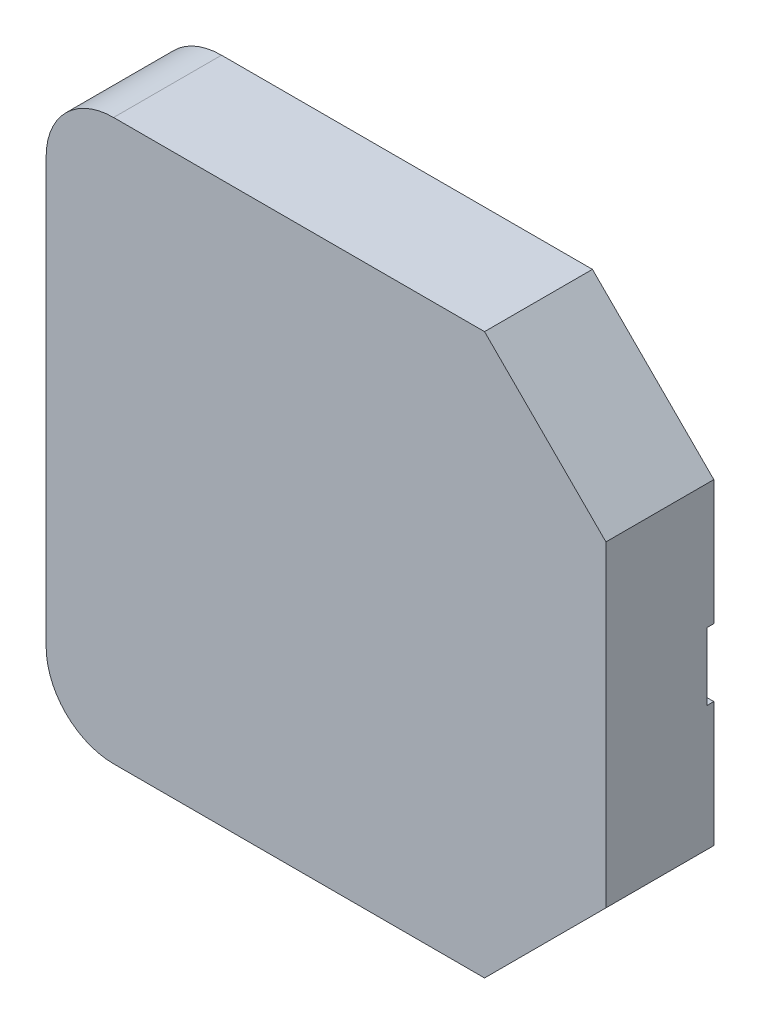
ISO-10303-21;
HEADER;
FILE_DESCRIPTION(('STEP AP214'),'2;1');
FILE_NAME('part.step','',(''),(''),'','','');
FILE_SCHEMA(('AUTOMOTIVE_DESIGN { 1 0 10303 214 1 1 1 1 }'));
ENDSEC;
DATA;
#1=APPLICATION_CONTEXT('core data for automotive mechanical design processes');
#2=APPLICATION_PROTOCOL_DEFINITION('international standard','automotive_design',2000,#1);
#3=PRODUCT_CONTEXT('',#1,'mechanical');
#4=PRODUCT('Part','Part','',(#3));
#5=PRODUCT_RELATED_PRODUCT_CATEGORY('part','',(#4));
#6=PRODUCT_DEFINITION_FORMATION('','',#4);
#7=PRODUCT_DEFINITION_CONTEXT('part definition',#1,'design');
#8=PRODUCT_DEFINITION('design','',#6,#7);
#9=PRODUCT_DEFINITION_SHAPE('','',#8);
#10=(LENGTH_UNIT() NAMED_UNIT(*) SI_UNIT(.MILLI.,.METRE.));
#11=(NAMED_UNIT(*) PLANE_ANGLE_UNIT() SI_UNIT($,.RADIAN.));
#12=(NAMED_UNIT(*) SI_UNIT($,.STERADIAN.) SOLID_ANGLE_UNIT());
#13=UNCERTAINTY_MEASURE_WITH_UNIT(LENGTH_MEASURE(1.E-05),#10,'distance_accuracy_value','');
#14=(GEOMETRIC_REPRESENTATION_CONTEXT(3) GLOBAL_UNCERTAINTY_ASSIGNED_CONTEXT((#13)) GLOBAL_UNIT_ASSIGNED_CONTEXT((#10,
#11,#12)) REPRESENTATION_CONTEXT('',''));
#15=CARTESIAN_POINT('',(0.,0.,0.));
#16=DIRECTION('',(0.,0.,1.));
#17=DIRECTION('',(1.,0.,0.));
#18=AXIS2_PLACEMENT_3D('',#15,#16,#17);
#19=CARTESIAN_POINT('',(4.15,4.494149457923,1.6));
#20=DIRECTION('',(0.,0.,1.));
#21=DIRECTION('',(1.,0.,0.));
#22=AXIS2_PLACEMENT_3D('',#19,#20,#21);
#23=PLANE('',#22);
#24=CARTESIAN_POINT('',(1.,7.644149457923,1.6));
#25=DIRECTION('',(0.,0.,-1.));
#26=DIRECTION('',(-0.707106781186547,0.707106781186548,0.));
#27=AXIS2_PLACEMENT_3D('',#24,#25,#26);
#28=CIRCLE('',#27,1.);
#29=CARTESIAN_POINT('',(0.,7.644149457923,1.6));
#30=VERTEX_POINT('',#29);
#31=CARTESIAN_POINT('',(0.292893218813453,8.35125623910955,1.6));
#32=VERTEX_POINT('',#31);
#33=EDGE_CURVE('E354',#30,#32,#28,.T.);
#34=ORIENTED_EDGE('',*,*,#33,.F.);
#35=DIRECTION('',(0.,1.,0.));
#36=VECTOR('',#35,1.);
#37=CARTESIAN_POINT('',(0.,1.344149457923,1.6));
#38=LINE('',#37,#36);
#39=CARTESIAN_POINT('',(0.,1.344149457923,1.6));
#40=VERTEX_POINT('',#39);
#41=EDGE_CURVE('E231',#40,#30,#38,.T.);
#42=ORIENTED_EDGE('',*,*,#41,.F.);
#43=CARTESIAN_POINT('',(1.,1.344149457923,1.6));
#44=DIRECTION('',(0.,0.,-1.));
#45=DIRECTION('',(-0.707106781186547,-0.707106781186548,0.));
#46=AXIS2_PLACEMENT_3D('',#43,#44,#45);
#47=CIRCLE('',#46,1.);
#48=CARTESIAN_POINT('',(0.292893218813453,0.637042676736448,1.6));
#49=VERTEX_POINT('',#48);
#50=EDGE_CURVE('E263',#49,#40,#47,.T.);
#51=ORIENTED_EDGE('',*,*,#50,.F.);
#52=CARTESIAN_POINT('',(1.,1.344149457923,1.6));
#53=DIRECTION('',(0.,0.,-1.));
#54=DIRECTION('',(-0.707106781186547,-0.707106781186548,0.));
#55=AXIS2_PLACEMENT_3D('',#52,#53,#54);
#56=CIRCLE('',#55,1.);
#57=CARTESIAN_POINT('',(1.,0.344149457922996,1.6));
#58=VERTEX_POINT('',#57);
#59=EDGE_CURVE('E336',#58,#49,#56,.T.);
#60=ORIENTED_EDGE('',*,*,#59,.F.);
#61=DIRECTION('',(-1.,0.,0.));
#62=VECTOR('',#61,1.);
#63=CARTESIAN_POINT('',(6.5,0.344149457922996,1.6));
#64=LINE('',#63,#62);
#65=CARTESIAN_POINT('',(6.5,0.344149457922996,1.6));
#66=VERTEX_POINT('',#65);
#67=EDGE_CURVE('E262',#66,#58,#64,.T.);
#68=ORIENTED_EDGE('',*,*,#67,.F.);
#69=DIRECTION('',(-0.707106781186548,-0.707106781186547,0.));
#70=VECTOR('',#69,1.);
#71=CARTESIAN_POINT('',(8.3,2.144149457923,1.6));
#72=LINE('',#71,#70);
#73=CARTESIAN_POINT('',(8.3,2.144149457923,1.6));
#74=VERTEX_POINT('',#73);
#75=EDGE_CURVE('E319',#74,#66,#72,.T.);
#76=ORIENTED_EDGE('',*,*,#75,.F.);
#77=DIRECTION('',(0.,-1.,0.));
#78=VECTOR('',#77,1.);
#79=CARTESIAN_POINT('',(8.3,6.844149457923,1.6));
#80=LINE('',#79,#78);
#81=CARTESIAN_POINT('',(8.3,6.844149457923,1.6));
#82=VERTEX_POINT('',#81);
#83=EDGE_CURVE('E11',#82,#74,#80,.T.);
#84=ORIENTED_EDGE('',*,*,#83,.F.);
#85=DIRECTION('',(0.707106781186547,-0.707106781186548,0.));
#86=VECTOR('',#85,1.);
#87=CARTESIAN_POINT('',(6.5,8.644149457923,1.6));
#88=LINE('',#87,#86);
#89=CARTESIAN_POINT('',(6.5,8.644149457923,1.6));
#90=VERTEX_POINT('',#89);
#91=EDGE_CURVE('E313',#90,#82,#88,.T.);
#92=ORIENTED_EDGE('',*,*,#91,.F.);
#93=DIRECTION('',(1.,0.,0.));
#94=VECTOR('',#93,1.);
#95=CARTESIAN_POINT('',(1.,8.644149457923,1.6));
#96=LINE('',#95,#94);
#97=CARTESIAN_POINT('',(1.,8.644149457923,1.6));
#98=VERTEX_POINT('',#97);
#99=EDGE_CURVE('E317',#98,#90,#96,.T.);
#100=ORIENTED_EDGE('',*,*,#99,.F.);
#101=CARTESIAN_POINT('',(1.,7.644149457923,1.6));
#102=DIRECTION('',(0.,0.,-1.));
#103=DIRECTION('',(-0.707106781186547,0.707106781186548,0.));
#104=AXIS2_PLACEMENT_3D('',#101,#102,#103);
#105=CIRCLE('',#104,1.);
#106=EDGE_CURVE('E234',#32,#98,#105,.T.);
#107=ORIENTED_EDGE('',*,*,#106,.F.);
#108=EDGE_LOOP('',(#34,#42,#51,#60,#68,#76,#84,#92,#100,#107));
#109=FACE_BOUND('',#108,.T.);
#110=ADVANCED_FACE('F17',(#109),#23,.T.);
#111=CARTESIAN_POINT('',(8.3,8.644149457923,0.));
#112=DIRECTION('',(1.,0.,0.));
#113=DIRECTION('',(0.,1.,0.));
#114=AXIS2_PLACEMENT_3D('',#111,#112,#113);
#115=PLANE('',#114);
#116=DIRECTION('',(0.,0.,-1.));
#117=VECTOR('',#116,1.);
#118=CARTESIAN_POINT('',(8.3,4.99414945792299,0.1));
#119=LINE('',#118,#117);
#120=CARTESIAN_POINT('',(8.3,4.99414945792299,0.1));
#121=VERTEX_POINT('',#120);
#122=CARTESIAN_POINT('',(8.3,4.99414945792299,0.));
#123=VERTEX_POINT('',#122);
#124=EDGE_CURVE('E184',#121,#123,#119,.T.);
#125=ORIENTED_EDGE('',*,*,#124,.T.);
#126=DIRECTION('',(0.,1.,0.));
#127=VECTOR('',#126,1.);
#128=CARTESIAN_POINT('',(8.3,4.994149457923,0.));
#129=LINE('',#128,#127);
#130=CARTESIAN_POINT('',(8.3,6.844149457923,0.));
#131=VERTEX_POINT('',#130);
#132=EDGE_CURVE('E300',#123,#131,#129,.T.);
#133=ORIENTED_EDGE('',*,*,#132,.T.);
#134=DIRECTION('',(0.,0.,-1.));
#135=VECTOR('',#134,1.);
#136=CARTESIAN_POINT('',(8.3,6.844149457923,1.6));
#137=LINE('',#136,#135);
#138=EDGE_CURVE('E309',#82,#131,#137,.T.);
#139=ORIENTED_EDGE('',*,*,#138,.F.);
#140=ORIENTED_EDGE('',*,*,#83,.T.);
#141=DIRECTION('',(0.,0.,1.));
#142=VECTOR('',#141,1.);
#143=CARTESIAN_POINT('',(8.3,2.144149457923,0.));
#144=LINE('',#143,#142);
#145=CARTESIAN_POINT('',(8.3,2.144149457923,0.));
#146=VERTEX_POINT('',#145);
#147=EDGE_CURVE('E26',#146,#74,#144,.T.);
#148=ORIENTED_EDGE('',*,*,#147,.F.);
#149=DIRECTION('',(0.,1.,0.));
#150=VECTOR('',#149,1.);
#151=CARTESIAN_POINT('',(8.3,2.144149457923,0.));
#152=LINE('',#151,#150);
#153=CARTESIAN_POINT('',(8.3,3.99414945792299,0.));
#154=VERTEX_POINT('',#153);
#155=EDGE_CURVE('E267',#146,#154,#152,.T.);
#156=ORIENTED_EDGE('',*,*,#155,.T.);
#157=DIRECTION('',(0.,0.,1.));
#158=VECTOR('',#157,1.);
#159=CARTESIAN_POINT('',(8.3,3.994149457923,0.));
#160=LINE('',#159,#158);
#161=CARTESIAN_POINT('',(8.3,3.99414945792299,0.1));
#162=VERTEX_POINT('',#161);
#163=EDGE_CURVE('E187',#154,#162,#160,.T.);
#164=ORIENTED_EDGE('',*,*,#163,.T.);
#165=DIRECTION('',(0.,1.,0.));
#166=VECTOR('',#165,1.);
#167=CARTESIAN_POINT('',(8.3,3.99414945792299,0.1));
#168=LINE('',#167,#166);
#169=EDGE_CURVE('E181',#162,#121,#168,.T.);
#170=ORIENTED_EDGE('',*,*,#169,.T.);
#171=EDGE_LOOP('',(#125,#133,#139,#140,#148,#156,#164,#170));
#172=FACE_BOUND('',#171,.T.);
#173=ADVANCED_FACE('F19',(#172),#115,.T.);
#174=CARTESIAN_POINT('',(7.4,1.244149457923,0.));
#175=DIRECTION('',(0.707106781186547,-0.707106781186548,0.));
#176=DIRECTION('',(0.,0.,-1.));
#177=AXIS2_PLACEMENT_3D('',#174,#175,#176);
#178=PLANE('',#177);
#179=ORIENTED_EDGE('',*,*,#75,.T.);
#180=DIRECTION('',(0.,0.,-1.));
#181=VECTOR('',#180,1.);
#182=CARTESIAN_POINT('',(6.5,0.344149457922996,1.6));
#183=LINE('',#182,#181);
#184=CARTESIAN_POINT('',(6.5,0.344149457922996,0.));
#185=VERTEX_POINT('',#184);
#186=EDGE_CURVE('E259',#66,#185,#183,.T.);
#187=ORIENTED_EDGE('',*,*,#186,.T.);
#188=DIRECTION('',(0.707106781186548,0.707106781186547,0.));
#189=VECTOR('',#188,1.);
#190=CARTESIAN_POINT('',(6.5,0.344149457922996,0.));
#191=LINE('',#190,#189);
#192=EDGE_CURVE('E273',#185,#146,#191,.T.);
#193=ORIENTED_EDGE('',*,*,#192,.T.);
#194=ORIENTED_EDGE('',*,*,#147,.T.);
#195=EDGE_LOOP('',(#179,#187,#193,#194));
#196=FACE_BOUND('',#195,.T.);
#197=ADVANCED_FACE('F450',(#196),#178,.T.);
#198=CARTESIAN_POINT('',(0.,8.644149457923,0.));
#199=DIRECTION('',(0.,1.,0.));
#200=DIRECTION('',(1.,0.,0.));
#201=AXIS2_PLACEMENT_3D('',#198,#199,#200);
#202=PLANE('',#201);
#203=DIRECTION('',(0.,0.,-1.));
#204=VECTOR('',#203,1.);
#205=CARTESIAN_POINT('',(1.,8.644149457923,1.6));
#206=LINE('',#205,#204);
#207=CARTESIAN_POINT('',(1.,8.644149457923,0.));
#208=VERTEX_POINT('',#207);
#209=EDGE_CURVE('E288',#98,#208,#206,.T.);
#210=ORIENTED_EDGE('',*,*,#209,.F.);
#211=ORIENTED_EDGE('',*,*,#99,.T.);
#212=DIRECTION('',(0.,0.,1.));
#213=VECTOR('',#212,1.);
#214=CARTESIAN_POINT('',(6.5,8.644149457923,0.));
#215=LINE('',#214,#213);
#216=CARTESIAN_POINT('',(6.5,8.644149457923,0.));
#217=VERTEX_POINT('',#216);
#218=EDGE_CURVE('E312',#217,#90,#215,.T.);
#219=ORIENTED_EDGE('',*,*,#218,.F.);
#220=DIRECTION('',(-1.,0.,0.));
#221=VECTOR('',#220,1.);
#222=CARTESIAN_POINT('',(6.5,8.644149457923,0.));
#223=LINE('',#222,#221);
#224=EDGE_CURVE('E219',#217,#208,#223,.T.);
#225=ORIENTED_EDGE('',*,*,#224,.T.);
#226=EDGE_LOOP('',(#210,#211,#219,#225));
#227=FACE_BOUND('',#226,.T.);
#228=ADVANCED_FACE('F455',(#227),#202,.T.);
#229=CARTESIAN_POINT('',(7.4,7.744149457923,0.));
#230=DIRECTION('',(0.707106781186548,0.707106781186548,0.));
#231=DIRECTION('',(0.,0.,-1.));
#232=AXIS2_PLACEMENT_3D('',#229,#230,#231);
#233=PLANE('',#232);
#234=ORIENTED_EDGE('',*,*,#91,.T.);
#235=ORIENTED_EDGE('',*,*,#138,.T.);
#236=DIRECTION('',(-0.707106781186547,0.707106781186548,0.));
#237=VECTOR('',#236,1.);
#238=CARTESIAN_POINT('',(8.3,6.844149457923,0.));
#239=LINE('',#238,#237);
#240=EDGE_CURVE('E223',#131,#217,#239,.T.);
#241=ORIENTED_EDGE('',*,*,#240,.T.);
#242=ORIENTED_EDGE('',*,*,#218,.T.);
#243=EDGE_LOOP('',(#234,#235,#241,#242));
#244=FACE_BOUND('',#243,.T.);
#245=ADVANCED_FACE('F453',(#244),#233,.T.);
#246=CARTESIAN_POINT('',(8.3,0.344149457922996,0.));
#247=DIRECTION('',(0.,-1.,0.));
#248=DIRECTION('',(0.,0.,-1.));
#249=AXIS2_PLACEMENT_3D('',#246,#247,#248);
#250=PLANE('',#249);
#251=DIRECTION('',(0.,0.,1.));
#252=VECTOR('',#251,1.);
#253=CARTESIAN_POINT('',(1.,0.344149457922996,0.));
#254=LINE('',#253,#252);
#255=CARTESIAN_POINT('',(1.,0.344149457922996,0.));
#256=VERTEX_POINT('',#255);
#257=EDGE_CURVE('E332',#256,#58,#254,.T.);
#258=ORIENTED_EDGE('',*,*,#257,.F.);
#259=DIRECTION('',(1.,0.,0.));
#260=VECTOR('',#259,1.);
#261=CARTESIAN_POINT('',(1.,0.344149457922996,0.));
#262=LINE('',#261,#260);
#263=EDGE_CURVE('E277',#256,#185,#262,.T.);
#264=ORIENTED_EDGE('',*,*,#263,.T.);
#265=ORIENTED_EDGE('',*,*,#186,.F.);
#266=ORIENTED_EDGE('',*,*,#67,.T.);
#267=EDGE_LOOP('',(#258,#264,#265,#266));
#268=FACE_BOUND('',#267,.T.);
#269=ADVANCED_FACE('F377',(#268),#250,.T.);
#270=CARTESIAN_POINT('',(1.,1.344149457923,0.));
#271=DIRECTION('',(0.,0.,-1.));
#272=DIRECTION('',(-0.707106781186547,-0.707106781186548,0.));
#273=AXIS2_PLACEMENT_3D('',#270,#271,#272);
#274=CYLINDRICAL_SURFACE('',#273,1.);
#275=DIRECTION('',(0.,0.,1.));
#276=VECTOR('',#275,1.);
#277=CARTESIAN_POINT('',(0.292893218813453,0.637042676736448,0.));
#278=LINE('',#277,#276);
#279=CARTESIAN_POINT('',(0.292893218813453,0.637042676736448,0.));
#280=VERTEX_POINT('',#279);
#281=EDGE_CURVE('E386',#280,#49,#278,.T.);
#282=ORIENTED_EDGE('',*,*,#281,.T.);
#283=ORIENTED_EDGE('',*,*,#50,.T.);
#284=DIRECTION('',(0.,0.,-1.));
#285=VECTOR('',#284,1.);
#286=CARTESIAN_POINT('',(0.,1.344149457923,1.6));
#287=LINE('',#286,#285);
#288=CARTESIAN_POINT('',(0.,1.344149457923,0.));
#289=VERTEX_POINT('',#288);
#290=EDGE_CURVE('E235',#40,#289,#287,.T.);
#291=ORIENTED_EDGE('',*,*,#290,.T.);
#292=CARTESIAN_POINT('',(1.,1.344149457923,0.));
#293=DIRECTION('',(0.,0.,1.));
#294=DIRECTION('',(-0.707106781186547,-0.707106781186548,0.));
#295=AXIS2_PLACEMENT_3D('',#292,#293,#294);
#296=CIRCLE('',#295,1.);
#297=EDGE_CURVE('E281',#289,#280,#296,.T.);
#298=ORIENTED_EDGE('',*,*,#297,.T.);
#299=EDGE_LOOP('',(#282,#283,#291,#298));
#300=FACE_BOUND('',#299,.T.);
#301=ADVANCED_FACE('F485',(#300),#274,.T.);
#302=CARTESIAN_POINT('',(1.,7.644149457923,0.));
#303=DIRECTION('',(0.,0.,-1.));
#304=DIRECTION('',(-0.707106781186547,0.707106781186548,0.));
#305=AXIS2_PLACEMENT_3D('',#302,#303,#304);
#306=CYLINDRICAL_SURFACE('',#305,1.);
#307=DIRECTION('',(0.,0.,1.));
#308=VECTOR('',#307,1.);
#309=CARTESIAN_POINT('',(0.292893218813453,8.35125623910955,0.));
#310=LINE('',#309,#308);
#311=CARTESIAN_POINT('',(0.292893218813453,8.35125623910955,0.));
#312=VERTEX_POINT('',#311);
#313=EDGE_CURVE('E346',#312,#32,#310,.T.);
#314=ORIENTED_EDGE('',*,*,#313,.T.);
#315=ORIENTED_EDGE('',*,*,#106,.T.);
#316=ORIENTED_EDGE('',*,*,#209,.T.);
#317=CARTESIAN_POINT('',(1.,7.644149457923,0.));
#318=DIRECTION('',(0.,0.,1.));
#319=DIRECTION('',(-0.707106781186547,0.707106781186548,0.));
#320=AXIS2_PLACEMENT_3D('',#317,#318,#319);
#321=CIRCLE('',#320,1.);
#322=EDGE_CURVE('E224',#208,#312,#321,.T.);
#323=ORIENTED_EDGE('',*,*,#322,.T.);
#324=EDGE_LOOP('',(#314,#315,#316,#323));
#325=FACE_BOUND('',#324,.T.);
#326=ADVANCED_FACE('F415',(#325),#306,.T.);
#327=CARTESIAN_POINT('',(0.,0.344149457922996,0.));
#328=DIRECTION('',(-1.,0.,0.));
#329=DIRECTION('',(0.,0.,1.));
#330=AXIS2_PLACEMENT_3D('',#327,#328,#329);
#331=PLANE('',#330);
#332=DIRECTION('',(0.,0.,1.));
#333=VECTOR('',#332,1.);
#334=CARTESIAN_POINT('',(0.,4.994149457923,0.));
#335=LINE('',#334,#333);
#336=CARTESIAN_POINT('',(0.,4.994149457923,0.));
#337=VERTEX_POINT('',#336);
#338=CARTESIAN_POINT('',(0.,4.994149457923,0.1));
#339=VERTEX_POINT('',#338);
#340=EDGE_CURVE('E239',#337,#339,#335,.T.);
#341=ORIENTED_EDGE('',*,*,#340,.T.);
#342=DIRECTION('',(0.,-1.,0.));
#343=VECTOR('',#342,1.);
#344=CARTESIAN_POINT('',(0.,4.994149457923,0.1));
#345=LINE('',#344,#343);
#346=CARTESIAN_POINT('',(0.,3.994149457923,0.1));
#347=VERTEX_POINT('',#346);
#348=EDGE_CURVE('E264',#339,#347,#345,.T.);
#349=ORIENTED_EDGE('',*,*,#348,.T.);
#350=DIRECTION('',(0.,0.,-1.));
#351=VECTOR('',#350,1.);
#352=CARTESIAN_POINT('',(0.,3.994149457923,0.1));
#353=LINE('',#352,#351);
#354=CARTESIAN_POINT('',(0.,3.994149457923,0.));
#355=VERTEX_POINT('',#354);
#356=EDGE_CURVE('E258',#347,#355,#353,.T.);
#357=ORIENTED_EDGE('',*,*,#356,.T.);
#358=DIRECTION('',(0.,-1.,0.));
#359=VECTOR('',#358,1.);
#360=CARTESIAN_POINT('',(0.,3.994149457923,0.));
#361=LINE('',#360,#359);
#362=EDGE_CURVE('E284',#355,#289,#361,.T.);
#363=ORIENTED_EDGE('',*,*,#362,.T.);
#364=ORIENTED_EDGE('',*,*,#290,.F.);
#365=ORIENTED_EDGE('',*,*,#41,.T.);
#366=DIRECTION('',(0.,0.,1.));
#367=VECTOR('',#366,1.);
#368=CARTESIAN_POINT('',(0.,7.644149457923,0.));
#369=LINE('',#368,#367);
#370=CARTESIAN_POINT('',(0.,7.644149457923,0.));
#371=VERTEX_POINT('',#370);
#372=EDGE_CURVE('E358',#371,#30,#369,.T.);
#373=ORIENTED_EDGE('',*,*,#372,.F.);
#374=DIRECTION('',(0.,-1.,0.));
#375=VECTOR('',#374,1.);
#376=CARTESIAN_POINT('',(0.,7.644149457923,0.));
#377=LINE('',#376,#375);
#378=EDGE_CURVE('E292',#371,#337,#377,.T.);
#379=ORIENTED_EDGE('',*,*,#378,.T.);
#380=EDGE_LOOP('',(#341,#349,#357,#363,#364,#365,#373,#379));
#381=FACE_BOUND('',#380,.T.);
#382=ADVANCED_FACE('F411',(#381),#331,.T.);
#383=CARTESIAN_POINT('',(4.15,4.494149457923,0.));
#384=DIRECTION('',(0.,0.,1.));
#385=DIRECTION('',(1.,0.,0.));
#386=AXIS2_PLACEMENT_3D('',#383,#384,#385);
#387=PLANE('',#386);
#388=DIRECTION('',(-1.,0.,0.));
#389=VECTOR('',#388,1.);
#390=CARTESIAN_POINT('',(8.3,4.99414945792299,0.));
#391=LINE('',#390,#389);
#392=CARTESIAN_POINT('',(5.25,4.994149457923,0.));
#393=VERTEX_POINT('',#392);
#394=EDGE_CURVE('E200',#123,#393,#391,.T.);
#395=ORIENTED_EDGE('',*,*,#394,.T.);
#396=CARTESIAN_POINT('',(5.25,4.494149457923,0.));
#397=DIRECTION('',(0.,0.,1.));
#398=DIRECTION('',(0.,1.,0.));
#399=AXIS2_PLACEMENT_3D('',#396,#397,#398);
#400=CIRCLE('',#399,0.5);
#401=CARTESIAN_POINT('',(5.25,3.994149457923,0.));
#402=VERTEX_POINT('',#401);
#403=EDGE_CURVE('E215',#393,#402,#400,.T.);
#404=ORIENTED_EDGE('',*,*,#403,.T.);
#405=DIRECTION('',(1.,0.,0.));
#406=VECTOR('',#405,1.);
#407=CARTESIAN_POINT('',(5.25,3.99414945792299,0.));
#408=LINE('',#407,#406);
#409=EDGE_CURVE('E342',#402,#154,#408,.T.);
#410=ORIENTED_EDGE('',*,*,#409,.T.);
#411=ORIENTED_EDGE('',*,*,#155,.F.);
#412=ORIENTED_EDGE('',*,*,#192,.F.);
#413=ORIENTED_EDGE('',*,*,#263,.F.);
#414=CARTESIAN_POINT('',(1.,1.344149457923,0.));
#415=DIRECTION('',(0.,0.,1.));
#416=DIRECTION('',(-0.707106781186547,-0.707106781186548,0.));
#417=AXIS2_PLACEMENT_3D('',#414,#415,#416);
#418=CIRCLE('',#417,1.);
#419=EDGE_CURVE('E337',#280,#256,#418,.T.);
#420=ORIENTED_EDGE('',*,*,#419,.F.);
#421=ORIENTED_EDGE('',*,*,#297,.F.);
#422=ORIENTED_EDGE('',*,*,#362,.F.);
#423=DIRECTION('',(1.,0.,0.));
#424=VECTOR('',#423,1.);
#425=CARTESIAN_POINT('',(0.,3.994149457923,0.));
#426=LINE('',#425,#424);
#427=CARTESIAN_POINT('',(3.05,3.994149457923,0.));
#428=VERTEX_POINT('',#427);
#429=EDGE_CURVE('E255',#355,#428,#426,.T.);
#430=ORIENTED_EDGE('',*,*,#429,.T.);
#431=CARTESIAN_POINT('',(3.05,4.494149457923,0.));
#432=DIRECTION('',(0.,0.,1.));
#433=DIRECTION('',(0.,1.,0.));
#434=AXIS2_PLACEMENT_3D('',#431,#432,#433);
#435=CIRCLE('',#434,0.5);
#436=CARTESIAN_POINT('',(3.05,4.994149457923,0.));
#437=VERTEX_POINT('',#436);
#438=EDGE_CURVE('E228',#428,#437,#435,.T.);
#439=ORIENTED_EDGE('',*,*,#438,.T.);
#440=DIRECTION('',(-1.,0.,0.));
#441=VECTOR('',#440,1.);
#442=CARTESIAN_POINT('',(3.05,4.994149457923,0.));
#443=LINE('',#442,#441);
#444=EDGE_CURVE('E243',#437,#337,#443,.T.);
#445=ORIENTED_EDGE('',*,*,#444,.T.);
#446=ORIENTED_EDGE('',*,*,#378,.F.);
#447=CARTESIAN_POINT('',(1.,7.644149457923,0.));
#448=DIRECTION('',(0.,0.,1.));
#449=DIRECTION('',(-0.707106781186547,0.707106781186548,0.));
#450=AXIS2_PLACEMENT_3D('',#447,#448,#449);
#451=CIRCLE('',#450,1.);
#452=EDGE_CURVE('E350',#312,#371,#451,.T.);
#453=ORIENTED_EDGE('',*,*,#452,.F.);
#454=ORIENTED_EDGE('',*,*,#322,.F.);
#455=ORIENTED_EDGE('',*,*,#224,.F.);
#456=ORIENTED_EDGE('',*,*,#240,.F.);
#457=ORIENTED_EDGE('',*,*,#132,.F.);
#458=EDGE_LOOP('',(#395,#404,#410,#411,#412,#413,#420,#421,#422,#430,#439,#445,#446,#453,#454,
#455,#456,#457));
#459=FACE_BOUND('',#458,.T.);
#460=ADVANCED_FACE('F418',(#459),#387,.F.);
#461=CARTESIAN_POINT('',(1.67738106772945,4.494149457923,0.1));
#462=DIRECTION('',(0.,0.,1.));
#463=DIRECTION('',(1.,0.,0.));
#464=AXIS2_PLACEMENT_3D('',#461,#462,#463);
#465=PLANE('',#464);
#466=DIRECTION('',(1.,0.,0.));
#467=VECTOR('',#466,1.);
#468=CARTESIAN_POINT('',(0.,4.994149457923,0.1));
#469=LINE('',#468,#467);
#470=CARTESIAN_POINT('',(3.05,4.994149457923,0.1));
#471=VERTEX_POINT('',#470);
#472=EDGE_CURVE('E193',#339,#471,#469,.T.);
#473=ORIENTED_EDGE('',*,*,#472,.T.);
#474=CARTESIAN_POINT('',(3.05,4.494149457923,0.1));
#475=DIRECTION('',(0.,0.,-1.));
#476=DIRECTION('',(0.,1.,0.));
#477=AXIS2_PLACEMENT_3D('',#474,#475,#476);
#478=CIRCLE('',#477,0.5);
#479=CARTESIAN_POINT('',(3.05,3.994149457923,0.1));
#480=VERTEX_POINT('',#479);
#481=EDGE_CURVE('E225',#471,#480,#478,.T.);
#482=ORIENTED_EDGE('',*,*,#481,.T.);
#483=DIRECTION('',(-1.,0.,0.));
#484=VECTOR('',#483,1.);
#485=CARTESIAN_POINT('',(3.05,3.994149457923,0.1));
#486=LINE('',#485,#484);
#487=EDGE_CURVE('E251',#480,#347,#486,.T.);
#488=ORIENTED_EDGE('',*,*,#487,.T.);
#489=ORIENTED_EDGE('',*,*,#348,.F.);
#490=EDGE_LOOP('',(#473,#482,#488,#489));
#491=FACE_BOUND('',#490,.T.);
#492=ADVANCED_FACE('F432',(#491),#465,.F.);
#493=CARTESIAN_POINT('',(3.05,3.994149457923,0.));
#494=DIRECTION('',(0.,-1.,0.));
#495=DIRECTION('',(0.,0.,-1.));
#496=AXIS2_PLACEMENT_3D('',#493,#494,#495);
#497=PLANE('',#496);
#498=ORIENTED_EDGE('',*,*,#487,.F.);
#499=DIRECTION('',(0.,0.,1.));
#500=VECTOR('',#499,1.);
#501=CARTESIAN_POINT('',(3.05,3.994149457923,0.));
#502=LINE('',#501,#500);
#503=EDGE_CURVE('E247',#428,#480,#502,.T.);
#504=ORIENTED_EDGE('',*,*,#503,.F.);
#505=ORIENTED_EDGE('',*,*,#429,.F.);
#506=ORIENTED_EDGE('',*,*,#356,.F.);
#507=EDGE_LOOP('',(#498,#504,#505,#506));
#508=FACE_BOUND('',#507,.T.);
#509=ADVANCED_FACE('F430',(#508),#497,.F.);
#510=CARTESIAN_POINT('',(3.05,4.494149457923,0.));
#511=DIRECTION('',(0.,0.,-1.));
#512=DIRECTION('',(0.,1.,0.));
#513=AXIS2_PLACEMENT_3D('',#510,#511,#512);
#514=CYLINDRICAL_SURFACE('',#513,0.5);
#515=ORIENTED_EDGE('',*,*,#481,.F.);
#516=DIRECTION('',(0.,0.,1.));
#517=VECTOR('',#516,1.);
#518=CARTESIAN_POINT('',(3.05,4.994149457923,0.));
#519=LINE('',#518,#517);
#520=EDGE_CURVE('E229',#437,#471,#519,.T.);
#521=ORIENTED_EDGE('',*,*,#520,.F.);
#522=ORIENTED_EDGE('',*,*,#438,.F.);
#523=ORIENTED_EDGE('',*,*,#503,.T.);
#524=EDGE_LOOP('',(#515,#521,#522,#523));
#525=FACE_BOUND('',#524,.T.);
#526=ADVANCED_FACE('F434',(#525),#514,.F.);
#527=CARTESIAN_POINT('',(0.,4.994149457923,0.));
#528=DIRECTION('',(0.,1.,0.));
#529=DIRECTION('',(1.,0.,0.));
#530=AXIS2_PLACEMENT_3D('',#527,#528,#529);
#531=PLANE('',#530);
#532=ORIENTED_EDGE('',*,*,#472,.F.);
#533=ORIENTED_EDGE('',*,*,#340,.F.);
#534=ORIENTED_EDGE('',*,*,#444,.F.);
#535=ORIENTED_EDGE('',*,*,#520,.T.);
#536=EDGE_LOOP('',(#532,#533,#534,#535));
#537=FACE_BOUND('',#536,.T.);
#538=ADVANCED_FACE('F425',(#537),#531,.F.);
#539=CARTESIAN_POINT('',(6.62261893227055,4.494149457923,0.1));
#540=DIRECTION('',(0.,0.,1.));
#541=DIRECTION('',(1.,0.,0.));
#542=AXIS2_PLACEMENT_3D('',#539,#540,#541);
#543=PLANE('',#542);
#544=ORIENTED_EDGE('',*,*,#169,.F.);
#545=DIRECTION('',(-1.,0.,0.));
#546=VECTOR('',#545,1.);
#547=CARTESIAN_POINT('',(8.3,3.99414945792299,0.1));
#548=LINE('',#547,#546);
#549=CARTESIAN_POINT('',(5.25,3.994149457923,0.1));
#550=VERTEX_POINT('',#549);
#551=EDGE_CURVE('E351',#162,#550,#548,.T.);
#552=ORIENTED_EDGE('',*,*,#551,.T.);
#553=CARTESIAN_POINT('',(5.25,4.494149457923,0.1));
#554=DIRECTION('',(0.,0.,-1.));
#555=DIRECTION('',(0.,1.,0.));
#556=AXIS2_PLACEMENT_3D('',#553,#554,#555);
#557=CIRCLE('',#556,0.5);
#558=CARTESIAN_POINT('',(5.25,4.994149457923,0.1));
#559=VERTEX_POINT('',#558);
#560=EDGE_CURVE('E205',#550,#559,#557,.T.);
#561=ORIENTED_EDGE('',*,*,#560,.T.);
#562=DIRECTION('',(1.,0.,0.));
#563=VECTOR('',#562,1.);
#564=CARTESIAN_POINT('',(5.25,4.994149457923,0.1));
#565=LINE('',#564,#563);
#566=EDGE_CURVE('E198',#559,#121,#565,.T.);
#567=ORIENTED_EDGE('',*,*,#566,.T.);
#568=EDGE_LOOP('',(#544,#552,#561,#567));
#569=FACE_BOUND('',#568,.T.);
#570=ADVANCED_FACE('F204',(#569),#543,.F.);
#571=CARTESIAN_POINT('',(5.25,4.994149457923,0.));
#572=DIRECTION('',(0.,1.,0.));
#573=DIRECTION('',(1.,0.,0.));
#574=AXIS2_PLACEMENT_3D('',#571,#572,#573);
#575=PLANE('',#574);
#576=ORIENTED_EDGE('',*,*,#566,.F.);
#577=DIRECTION('',(0.,0.,1.));
#578=VECTOR('',#577,1.);
#579=CARTESIAN_POINT('',(5.25,4.994149457923,0.));
#580=LINE('',#579,#578);
#581=EDGE_CURVE('E207',#393,#559,#580,.T.);
#582=ORIENTED_EDGE('',*,*,#581,.F.);
#583=ORIENTED_EDGE('',*,*,#394,.F.);
#584=ORIENTED_EDGE('',*,*,#124,.F.);
#585=EDGE_LOOP('',(#576,#582,#583,#584));
#586=FACE_BOUND('',#585,.T.);
#587=ADVANCED_FACE('F196',(#586),#575,.F.);
#588=CARTESIAN_POINT('',(5.25,4.494149457923,0.));
#589=DIRECTION('',(0.,0.,-1.));
#590=DIRECTION('',(0.,1.,0.));
#591=AXIS2_PLACEMENT_3D('',#588,#589,#590);
#592=CYLINDRICAL_SURFACE('',#591,0.5);
#593=ORIENTED_EDGE('',*,*,#560,.F.);
#594=DIRECTION('',(0.,0.,1.));
#595=VECTOR('',#594,1.);
#596=CARTESIAN_POINT('',(5.25,3.994149457923,0.));
#597=LINE('',#596,#595);
#598=EDGE_CURVE('E338',#402,#550,#597,.T.);
#599=ORIENTED_EDGE('',*,*,#598,.F.);
#600=ORIENTED_EDGE('',*,*,#403,.F.);
#601=ORIENTED_EDGE('',*,*,#581,.T.);
#602=EDGE_LOOP('',(#593,#599,#600,#601));
#603=FACE_BOUND('',#602,.T.);
#604=ADVANCED_FACE('F561',(#603),#592,.F.);
#605=CARTESIAN_POINT('',(8.3,3.99414945792299,0.));
#606=DIRECTION('',(0.,-1.,0.));
#607=DIRECTION('',(0.,0.,-1.));
#608=AXIS2_PLACEMENT_3D('',#605,#606,#607);
#609=PLANE('',#608);
#610=ORIENTED_EDGE('',*,*,#551,.F.);
#611=ORIENTED_EDGE('',*,*,#163,.F.);
#612=ORIENTED_EDGE('',*,*,#409,.F.);
#613=ORIENTED_EDGE('',*,*,#598,.T.);
#614=EDGE_LOOP('',(#610,#611,#612,#613));
#615=FACE_BOUND('',#614,.T.);
#616=ADVANCED_FACE('F570',(#615),#609,.F.);
#617=CARTESIAN_POINT('',(1.,7.644149457923,0.));
#618=DIRECTION('',(0.,0.,-1.));
#619=DIRECTION('',(-0.707106781186547,0.707106781186548,0.));
#620=AXIS2_PLACEMENT_3D('',#617,#618,#619);
#621=CYLINDRICAL_SURFACE('',#620,1.);
#622=ORIENTED_EDGE('',*,*,#313,.F.);
#623=ORIENTED_EDGE('',*,*,#452,.T.);
#624=ORIENTED_EDGE('',*,*,#372,.T.);
#625=ORIENTED_EDGE('',*,*,#33,.T.);
#626=EDGE_LOOP('',(#622,#623,#624,#625));
#627=FACE_BOUND('',#626,.T.);
#628=ADVANCED_FACE('F408',(#627),#621,.T.);
#629=CARTESIAN_POINT('',(1.,1.344149457923,0.));
#630=DIRECTION('',(0.,0.,-1.));
#631=DIRECTION('',(-0.707106781186547,-0.707106781186548,0.));
#632=AXIS2_PLACEMENT_3D('',#629,#630,#631);
#633=CYLINDRICAL_SURFACE('',#632,1.);
#634=ORIENTED_EDGE('',*,*,#281,.F.);
#635=ORIENTED_EDGE('',*,*,#419,.T.);
#636=ORIENTED_EDGE('',*,*,#257,.T.);
#637=ORIENTED_EDGE('',*,*,#59,.T.);
#638=EDGE_LOOP('',(#634,#635,#636,#637));
#639=FACE_BOUND('',#638,.T.);
#640=ADVANCED_FACE('F384',(#639),#633,.T.);
#641=CLOSED_SHELL('',(#110,#173,#197,#228,#245,#269,#301,#326,#382,#460,#492,#509,#526,#538,
#570,#587,#604,#616,#628,#640));
#642=MANIFOLD_SOLID_BREP('B1',#641);
#643=ADVANCED_BREP_SHAPE_REPRESENTATION('',(#18,#642),#14);
#644=SHAPE_DEFINITION_REPRESENTATION(#9,#643);
ENDSEC;
END-ISO-10303-21;
